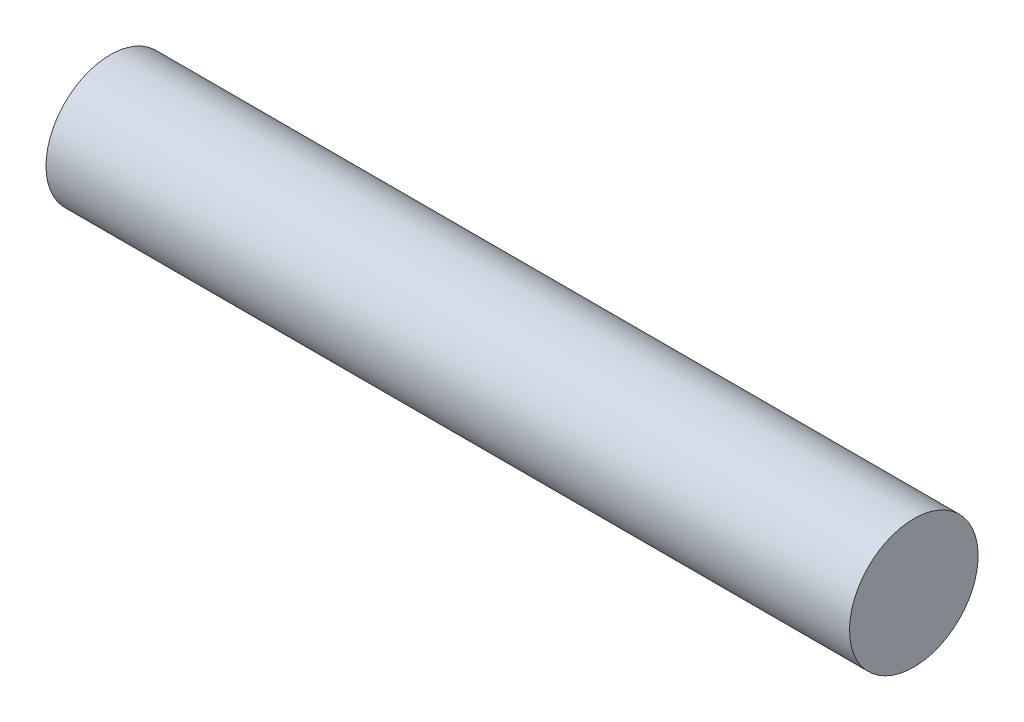
ISO-10303-21;
HEADER;
FILE_DESCRIPTION(('STEP AP214'),'2;1');
FILE_NAME('part.step','',(''),(''),'','','');
FILE_SCHEMA(('AUTOMOTIVE_DESIGN { 1 0 10303 214 1 1 1 1 }'));
ENDSEC;
DATA;
#1=APPLICATION_CONTEXT('core data for automotive mechanical design processes');
#2=APPLICATION_PROTOCOL_DEFINITION('international standard','automotive_design',2000,#1);
#3=PRODUCT_CONTEXT('',#1,'mechanical');
#4=PRODUCT('Part','Part','',(#3));
#5=PRODUCT_RELATED_PRODUCT_CATEGORY('part','',(#4));
#6=PRODUCT_DEFINITION_FORMATION('','',#4);
#7=PRODUCT_DEFINITION_CONTEXT('part definition',#1,'design');
#8=PRODUCT_DEFINITION('design','',#6,#7);
#9=PRODUCT_DEFINITION_SHAPE('','',#8);
#10=(LENGTH_UNIT() NAMED_UNIT(*) SI_UNIT(.MILLI.,.METRE.));
#11=(NAMED_UNIT(*) PLANE_ANGLE_UNIT() SI_UNIT($,.RADIAN.));
#12=(NAMED_UNIT(*) SI_UNIT($,.STERADIAN.) SOLID_ANGLE_UNIT());
#13=UNCERTAINTY_MEASURE_WITH_UNIT(LENGTH_MEASURE(1.E-05),#10,'distance_accuracy_value','');
#14=(GEOMETRIC_REPRESENTATION_CONTEXT(3) GLOBAL_UNCERTAINTY_ASSIGNED_CONTEXT((#13)) GLOBAL_UNIT_ASSIGNED_CONTEXT((#10,
#11,#12)) REPRESENTATION_CONTEXT('',''));
#15=CARTESIAN_POINT('',(0.,0.,0.));
#16=DIRECTION('',(0.,0.,1.));
#17=DIRECTION('',(1.,0.,0.));
#18=AXIS2_PLACEMENT_3D('',#15,#16,#17);
#19=CARTESIAN_POINT('',(20.,0.,0.));
#20=DIRECTION('',(-1.,0.,0.));
#21=DIRECTION('',(0.,0.,1.));
#22=AXIS2_PLACEMENT_3D('',#19,#20,#21);
#23=CYLINDRICAL_SURFACE('',#22,4.);
#24=CARTESIAN_POINT('',(0.,0.,0.));
#25=DIRECTION('',(-1.,0.,0.));
#26=DIRECTION('',(0.,0.,1.));
#27=AXIS2_PLACEMENT_3D('',#24,#25,#26);
#28=CIRCLE('',#27,4.);
#29=CARTESIAN_POINT('',(0.,0.,4.));
#30=VERTEX_POINT('',#29);
#31=EDGE_CURVE('E43',#30,#30,#28,.T.);
#32=ORIENTED_EDGE('',*,*,#31,.F.);
#33=EDGE_LOOP('',(#32));
#34=FACE_BOUND('',#33,.T.);
#35=CARTESIAN_POINT('',(50.,0.,0.));
#36=DIRECTION('',(-1.,0.,0.));
#37=DIRECTION('',(0.,0.,1.));
#38=AXIS2_PLACEMENT_3D('',#35,#36,#37);
#39=CIRCLE('',#38,4.);
#40=CARTESIAN_POINT('',(50.,0.,4.));
#41=VERTEX_POINT('',#40);
#42=EDGE_CURVE('E10',#41,#41,#39,.T.);
#43=ORIENTED_EDGE('',*,*,#42,.T.);
#44=EDGE_LOOP('',(#43));
#45=FACE_BOUND('',#44,.T.);
#46=ADVANCED_FACE('F29',(#34,#45),#23,.T.);
#47=CARTESIAN_POINT('',(50.,4.,0.));
#48=DIRECTION('',(-1.,0.,0.));
#49=DIRECTION('',(0.,0.,1.));
#50=AXIS2_PLACEMENT_3D('',#47,#48,#49);
#51=PLANE('',#50);
#52=ORIENTED_EDGE('',*,*,#42,.F.);
#53=EDGE_LOOP('',(#52));
#54=FACE_BOUND('',#53,.T.);
#55=ADVANCED_FACE('F52',(#54),#51,.F.);
#56=CARTESIAN_POINT('',(20.,3.,0.));
#57=DIRECTION('',(1.,0.,0.));
#58=DIRECTION('',(0.,0.,-1.));
#59=AXIS2_PLACEMENT_3D('',#56,#57,#58);
#60=PLANE('',#59);
#61=CARTESIAN_POINT('',(20.,0.,0.));
#62=DIRECTION('',(-1.,0.,0.));
#63=DIRECTION('',(0.,0.,1.));
#64=AXIS2_PLACEMENT_3D('',#61,#62,#63);
#65=CIRCLE('',#64,3.);
#66=CARTESIAN_POINT('',(20.,0.,3.));
#67=VERTEX_POINT('',#66);
#68=EDGE_CURVE('E35',#67,#67,#65,.T.);
#69=ORIENTED_EDGE('',*,*,#68,.T.);
#70=EDGE_LOOP('',(#69));
#71=FACE_BOUND('',#70,.T.);
#72=ADVANCED_FACE('F56',(#71),#60,.F.);
#73=CARTESIAN_POINT('',(20.,0.,0.));
#74=DIRECTION('',(-1.,0.,0.));
#75=DIRECTION('',(0.,0.,1.));
#76=AXIS2_PLACEMENT_3D('',#73,#74,#75);
#77=CYLINDRICAL_SURFACE('',#76,3.);
#78=ORIENTED_EDGE('',*,*,#68,.F.);
#79=EDGE_LOOP('',(#78));
#80=FACE_BOUND('',#79,.T.);
#81=CARTESIAN_POINT('',(0.,0.,0.));
#82=DIRECTION('',(-1.,0.,0.));
#83=DIRECTION('',(0.,0.,1.));
#84=AXIS2_PLACEMENT_3D('',#81,#82,#83);
#85=CIRCLE('',#84,3.);
#86=CARTESIAN_POINT('',(0.,0.,3.));
#87=VERTEX_POINT('',#86);
#88=EDGE_CURVE('E39',#87,#87,#85,.T.);
#89=ORIENTED_EDGE('',*,*,#88,.T.);
#90=EDGE_LOOP('',(#89));
#91=FACE_BOUND('',#90,.T.);
#92=ADVANCED_FACE('F61',(#80,#91),#77,.F.);
#93=CARTESIAN_POINT('',(0.,4.,0.));
#94=DIRECTION('',(1.,0.,0.));
#95=DIRECTION('',(0.,0.,-1.));
#96=AXIS2_PLACEMENT_3D('',#93,#94,#95);
#97=PLANE('',#96);
#98=ORIENTED_EDGE('',*,*,#88,.F.);
#99=EDGE_LOOP('',(#98));
#100=FACE_BOUND('',#99,.T.);
#101=ORIENTED_EDGE('',*,*,#31,.T.);
#102=EDGE_LOOP('',(#101));
#103=FACE_BOUND('',#102,.T.);
#104=ADVANCED_FACE('F49',(#100,#103),#97,.F.);
#105=CLOSED_SHELL('',(#46,#55,#72,#92,#104));
#106=MANIFOLD_SOLID_BREP('B2',#105);
#107=ADVANCED_BREP_SHAPE_REPRESENTATION('',(#18,#106),#14);
#108=SHAPE_DEFINITION_REPRESENTATION(#9,#107);
ENDSEC;
END-ISO-10303-21;
